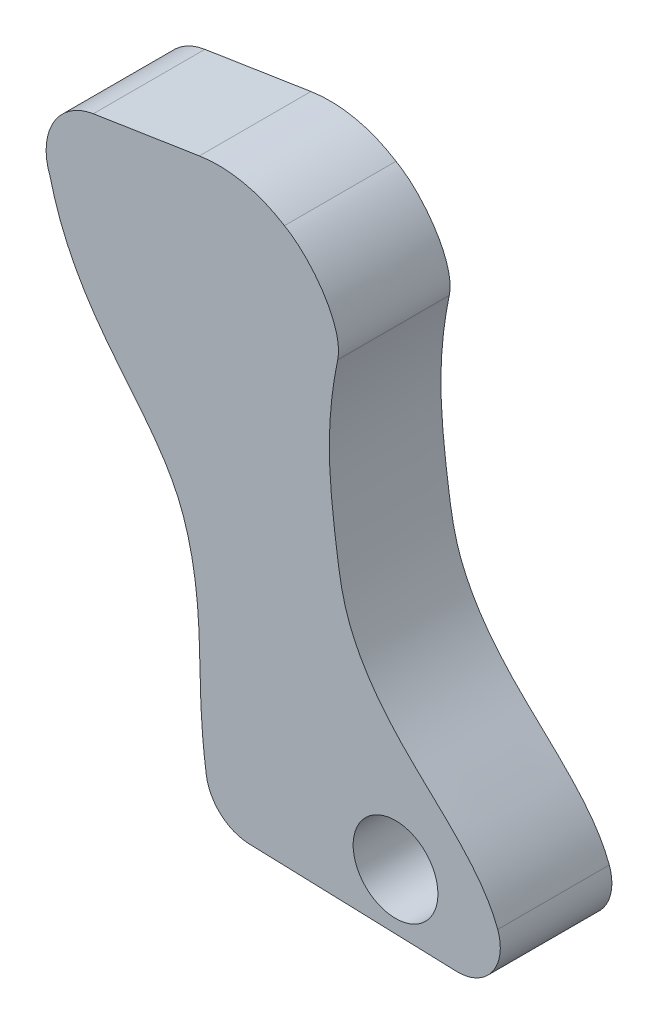
ISO-10303-21;
HEADER;
FILE_DESCRIPTION(('STEP AP214'),'2;1');
FILE_NAME('part.step','',(''),(''),'','','');
FILE_SCHEMA(('AUTOMOTIVE_DESIGN { 1 0 10303 214 1 1 1 1 }'));
ENDSEC;
DATA;
#1=APPLICATION_CONTEXT('core data for automotive mechanical design processes');
#2=APPLICATION_PROTOCOL_DEFINITION('international standard','automotive_design',2000,#1);
#3=PRODUCT_CONTEXT('',#1,'mechanical');
#4=PRODUCT('Part','Part','',(#3));
#5=PRODUCT_RELATED_PRODUCT_CATEGORY('part','',(#4));
#6=PRODUCT_DEFINITION_FORMATION('','',#4);
#7=PRODUCT_DEFINITION_CONTEXT('part definition',#1,'design');
#8=PRODUCT_DEFINITION('design','',#6,#7);
#9=PRODUCT_DEFINITION_SHAPE('','',#8);
#10=(LENGTH_UNIT() NAMED_UNIT(*) SI_UNIT(.MILLI.,.METRE.));
#11=(NAMED_UNIT(*) PLANE_ANGLE_UNIT() SI_UNIT($,.RADIAN.));
#12=(NAMED_UNIT(*) SI_UNIT($,.STERADIAN.) SOLID_ANGLE_UNIT());
#13=UNCERTAINTY_MEASURE_WITH_UNIT(LENGTH_MEASURE(1.E-05),#10,'distance_accuracy_value','');
#14=(GEOMETRIC_REPRESENTATION_CONTEXT(3) GLOBAL_UNCERTAINTY_ASSIGNED_CONTEXT((#13)) GLOBAL_UNIT_ASSIGNED_CONTEXT((#10,
#11,#12)) REPRESENTATION_CONTEXT('',''));
#15=CARTESIAN_POINT('',(0.,0.,0.));
#16=DIRECTION('',(0.,0.,1.));
#17=DIRECTION('',(1.,0.,0.));
#18=AXIS2_PLACEMENT_3D('',#15,#16,#17);
#19=CARTESIAN_POINT('',(-3.14253839049253,-0.228921941063467,0.));
#20=DIRECTION('',(0.,0.,-1.));
#21=DIRECTION('',(-1.,0.,0.));
#22=AXIS2_PLACEMENT_3D('',#19,#20,#21);
#23=PLANE('',#22);
#24=CARTESIAN_POINT('',(-6.05644366956368,4.64993578043893,0.));
#25=CARTESIAN_POINT('',(-5.47257523519971,2.24763452070451,0.));
#26=CARTESIAN_POINT('',(-3.14032497150458,0.912909200360138,0.));
#27=CARTESIAN_POINT('',(-2.56443138436627,-2.64735000201732,0.));
#28=CARTESIAN_POINT('',(-2.67735740290415,-4.14670790830453,0.));
#29=CARTESIAN_POINT('',(-2.4960943710409,-5.38562553156056,0.));
#30=B_SPLINE_CURVE_WITH_KNOTS('',3,(#24,#25,#26,#27,#28,#29),.UNSPECIFIED.,.F.,.F.,(4,1,1,4),
(0.,0.493395358191739,0.716015144874953,1.),.UNSPECIFIED.);
#31=CARTESIAN_POINT('',(-6.05644366956368,4.64993578043893,0.));
#32=VERTEX_POINT('',#31);
#33=CARTESIAN_POINT('',(-2.4960943710409,-5.38562553156056,0.));
#34=VERTEX_POINT('',#33);
#35=EDGE_CURVE('E140',#32,#34,#30,.T.);
#36=ORIENTED_EDGE('',*,*,#35,.F.);
#37=CARTESIAN_POINT('',(-4.87377055732532,5.11273628777276,0.));
#38=DIRECTION('',(0.,0.,1.));
#39=DIRECTION('',(-1.,0.,0.));
#40=AXIS2_PLACEMENT_3D('',#37,#38,#39);
#41=CIRCLE('',#40,1.27);
#42=CARTESIAN_POINT('',(-5.06916030594105,6.36761590197321,0.));
#43=VERTEX_POINT('',#42);
#44=EDGE_CURVE('E92',#43,#32,#41,.T.);
#45=ORIENTED_EDGE('',*,*,#44,.F.);
#46=DIRECTION('',(-0.988094184409806,-0.153850195760421,0.));
#47=VECTOR('',#46,1.);
#48=CARTESIAN_POINT('',(-5.06916030594105,6.36761590197321,0.));
#49=LINE('',#48,#47);
#50=CARTESIAN_POINT('',(-2.65503300036844,6.74350512833758,0.));
#51=VERTEX_POINT('',#50);
#52=EDGE_CURVE('E86',#51,#43,#49,.T.);
#53=ORIENTED_EDGE('',*,*,#52,.F.);
#54=CARTESIAN_POINT('',(-2.22517555341382,3.98276997709658,0.));
#55=DIRECTION('',(0.,0.,1.));
#56=DIRECTION('',(-1.,0.,0.));
#57=AXIS2_PLACEMENT_3D('',#54,#55,#56);
#58=CIRCLE('',#57,2.794);
#59=CARTESIAN_POINT('',(-0.718288865311653,6.33558287004419,0.));
#60=VERTEX_POINT('',#59);
#61=EDGE_CURVE('E130',#60,#51,#58,.T.);
#62=ORIENTED_EDGE('',*,*,#61,.F.);
#63=CARTESIAN_POINT('',(0.493851252231017,4.29665474391861,0.));
#64=CARTESIAN_POINT('',(0.640025428869317,5.00437062487667,0.));
#65=CARTESIAN_POINT('',(-0.121151201390224,6.00722954467493,0.));
#66=CARTESIAN_POINT('',(-0.718288865311653,6.33558287004419,0.));
#67=B_SPLINE_CURVE_WITH_KNOTS('',3,(#63,#64,#65,#66),.UNSPECIFIED.,.F.,.F.,(4,4),(0.,1.),.UNSPECIFIED.);
#68=CARTESIAN_POINT('',(0.493851252231017,4.29665474391861,0.));
#69=VERTEX_POINT('',#68);
#70=EDGE_CURVE('E159',#69,#60,#67,.T.);
#71=ORIENTED_EDGE('',*,*,#70,.F.);
#72=CARTESIAN_POINT('',(4.13756289532083,-5.11048341112105,0.));
#73=CARTESIAN_POINT('',(3.75170873669739,-4.057424722297,0.));
#74=CARTESIAN_POINT('',(1.96035292210392,-2.83840642684243,0.));
#75=CARTESIAN_POINT('',(0.682892056801707,-0.893226264426887,0.));
#76=CARTESIAN_POINT('',(0.419560201608327,0.841832203224972,0.));
#77=CARTESIAN_POINT('',(0.235366213775803,2.46513810879299,0.));
#78=CARTESIAN_POINT('',(0.366891084627688,3.68196527599495,0.));
#79=CARTESIAN_POINT('',(0.493851252231017,4.29665474391861,0.));
#80=B_SPLINE_CURVE_WITH_KNOTS('',3,(#72,#73,#74,#75,#76,#77,#78,#79),.UNSPECIFIED.,.F.,.F.,(4,1,
1,1,1,4),(0.,0.339614962532623,0.54378550735165,0.64451461107271,0.831601298882967,1.),.UNSPECIFIED.);
#81=CARTESIAN_POINT('',(4.13756289532083,-5.11048341112105,0.));
#82=VERTEX_POINT('',#81);
#83=EDGE_CURVE('E155',#82,#69,#80,.T.);
#84=ORIENTED_EDGE('',*,*,#83,.F.);
#85=CARTESIAN_POINT('',(3.23128512850863,-5.44255516448454,0.));
#86=DIRECTION('',(0.,0.,1.));
#87=DIRECTION('',(1.,0.,0.));
#88=AXIS2_PLACEMENT_3D('',#85,#86,#87);
#89=CIRCLE('',#88,0.965200000000001);
#90=CARTESIAN_POINT('',(3.19999026264176,-6.40724769133979,0.));
#91=VERTEX_POINT('',#90);
#92=EDGE_CURVE('E153',#91,#82,#89,.T.);
#93=ORIENTED_EDGE('',*,*,#92,.F.);
#94=DIRECTION('',(0.99947423006139,-0.0324231929826821,0.));
#95=VECTOR('',#94,1.);
#96=CARTESIAN_POINT('',(-1.52373901334253,-6.25400873699098,0.));
#97=LINE('',#96,#95);
#98=CARTESIAN_POINT('',(-1.52373901334253,-6.25400873699098,0.));
#99=VERTEX_POINT('',#98);
#100=EDGE_CURVE('E151',#99,#91,#97,.T.);
#101=ORIENTED_EDGE('',*,*,#100,.F.);
#102=CARTESIAN_POINT('',(-1.49079704927213,-5.23854291924861,0.));
#103=DIRECTION('',(0.,0.,1.));
#104=DIRECTION('',(1.,0.,0.));
#105=AXIS2_PLACEMENT_3D('',#102,#103,#104);
#106=CIRCLE('',#105,1.016);
#107=EDGE_CURVE('E145',#34,#99,#106,.T.);
#108=ORIENTED_EDGE('',*,*,#107,.F.);
#109=EDGE_LOOP('',(#36,#45,#53,#62,#71,#84,#93,#101,#108));
#110=FACE_BOUND('',#109,.T.);
#111=CARTESIAN_POINT('',(1.81120295072788,-5.0915270059297,0.));
#112=DIRECTION('',(0.,0.,1.));
#113=DIRECTION('',(1.,0.,0.));
#114=AXIS2_PLACEMENT_3D('',#111,#112,#113);
#115=CIRCLE('',#114,0.965199999999998);
#116=CARTESIAN_POINT('',(2.77640295072788,-5.0915270059297,0.));
#117=VERTEX_POINT('',#116);
#118=EDGE_CURVE('E146',#117,#117,#115,.T.);
#119=ORIENTED_EDGE('',*,*,#118,.T.);
#120=EDGE_LOOP('',(#119));
#121=FACE_BOUND('',#120,.T.);
#122=ADVANCED_FACE('F36',(#110,#121),#23,.T.);
#123=CARTESIAN_POINT('',(-6.05644366956368,4.64993578043894,2.54));
#124=CARTESIAN_POINT('',(-5.47257523519971,2.24763452070451,2.54));
#125=CARTESIAN_POINT('',(-3.1403249715046,0.912909200360142,2.54));
#126=CARTESIAN_POINT('',(-2.56443138436627,-2.64735000201731,2.54));
#127=CARTESIAN_POINT('',(-2.67735740290415,-4.14670790830453,2.54));
#128=CARTESIAN_POINT('',(-2.4960943710409,-5.38562553156056,2.54));
#129=B_SPLINE_CURVE_WITH_KNOTS('',3,(#123,#124,#125,#126,#127,#128),.UNSPECIFIED.,.F.,.F.,(4,1,
1,4),(0.,0.493395358191739,0.716015144874953,1.),.UNSPECIFIED.);
#130=DIRECTION('',(0.,0.,-1.));
#131=VECTOR('',#130,1.);
#132=SURFACE_OF_LINEAR_EXTRUSION('',#129,#131);
#133=ORIENTED_EDGE('',*,*,#35,.T.);
#134=DIRECTION('',(0.,0.,-1.));
#135=VECTOR('',#134,1.);
#136=CARTESIAN_POINT('',(-2.4960943710409,-5.38562553156056,2.54));
#137=LINE('',#136,#135);
#138=CARTESIAN_POINT('',(-2.4960943710409,-5.38562553156056,2.54));
#139=VERTEX_POINT('',#138);
#140=EDGE_CURVE('E11',#139,#34,#137,.T.);
#141=ORIENTED_EDGE('',*,*,#140,.F.);
#142=CARTESIAN_POINT('',(-6.05644366956368,4.64993578043894,2.54));
#143=VERTEX_POINT('',#142);
#144=EDGE_CURVE('E172',#143,#139,#129,.T.);
#145=ORIENTED_EDGE('',*,*,#144,.F.);
#146=DIRECTION('',(0.,0.,-1.));
#147=VECTOR('',#146,1.);
#148=CARTESIAN_POINT('',(-6.05644366956368,4.64993578043894,2.54));
#149=LINE('',#148,#147);
#150=EDGE_CURVE('E136',#143,#32,#149,.T.);
#151=ORIENTED_EDGE('',*,*,#150,.T.);
#152=EDGE_LOOP('',(#133,#141,#145,#151));
#153=FACE_BOUND('',#152,.T.);
#154=ADVANCED_FACE('F38',(#153),#132,.F.);
#155=CARTESIAN_POINT('',(-1.49079704927213,-5.23854291924861,2.54));
#156=DIRECTION('',(0.,0.,-1.));
#157=DIRECTION('',(-1.,0.,0.));
#158=AXIS2_PLACEMENT_3D('',#155,#156,#157);
#159=CYLINDRICAL_SURFACE('',#158,1.016);
#160=ORIENTED_EDGE('',*,*,#107,.T.);
#161=DIRECTION('',(0.,0.,-1.));
#162=VECTOR('',#161,1.);
#163=CARTESIAN_POINT('',(-1.52373901334253,-6.25400873699098,2.54));
#164=LINE('',#163,#162);
#165=CARTESIAN_POINT('',(-1.52373901334253,-6.25400873699098,2.54));
#166=VERTEX_POINT('',#165);
#167=EDGE_CURVE('E46',#166,#99,#164,.T.);
#168=ORIENTED_EDGE('',*,*,#167,.F.);
#169=CARTESIAN_POINT('',(-1.49079704927213,-5.23854291924861,2.54));
#170=DIRECTION('',(0.,0.,1.));
#171=DIRECTION('',(1.,0.,0.));
#172=AXIS2_PLACEMENT_3D('',#169,#170,#171);
#173=CIRCLE('',#172,1.016);
#174=EDGE_CURVE('E100',#139,#166,#173,.T.);
#175=ORIENTED_EDGE('',*,*,#174,.F.);
#176=ORIENTED_EDGE('',*,*,#140,.T.);
#177=EDGE_LOOP('',(#160,#168,#175,#176));
#178=FACE_BOUND('',#177,.T.);
#179=ADVANCED_FACE('F228',(#178),#159,.T.);
#180=CARTESIAN_POINT('',(-1.52373901334253,-6.25400873699098,2.54));
#181=DIRECTION('',(0.032423192982682,0.99947423006139,0.));
#182=DIRECTION('',(-0.99947423006139,0.032423192982682,0.));
#183=AXIS2_PLACEMENT_3D('',#180,#181,#182);
#184=PLANE('',#183);
#185=ORIENTED_EDGE('',*,*,#100,.T.);
#186=DIRECTION('',(0.,0.,-1.));
#187=VECTOR('',#186,1.);
#188=CARTESIAN_POINT('',(3.19999026264174,-6.40724769133978,2.54));
#189=LINE('',#188,#187);
#190=CARTESIAN_POINT('',(3.19999026264174,-6.40724769133978,2.54));
#191=VERTEX_POINT('',#190);
#192=EDGE_CURVE('E182',#191,#91,#189,.T.);
#193=ORIENTED_EDGE('',*,*,#192,.F.);
#194=DIRECTION('',(0.99947423006139,-0.0324231929826821,0.));
#195=VECTOR('',#194,1.);
#196=CARTESIAN_POINT('',(-1.52373901334253,-6.25400873699098,2.54));
#197=LINE('',#196,#195);
#198=EDGE_CURVE('E190',#166,#191,#197,.T.);
#199=ORIENTED_EDGE('',*,*,#198,.F.);
#200=ORIENTED_EDGE('',*,*,#167,.T.);
#201=EDGE_LOOP('',(#185,#193,#199,#200));
#202=FACE_BOUND('',#201,.T.);
#203=ADVANCED_FACE('F188',(#202),#184,.F.);
#204=CARTESIAN_POINT('',(3.23128512850863,-5.44255516448453,2.54));
#205=DIRECTION('',(0.,0.,-1.));
#206=DIRECTION('',(-1.,0.,0.));
#207=AXIS2_PLACEMENT_3D('',#204,#205,#206);
#208=CYLINDRICAL_SURFACE('',#207,0.965200000000001);
#209=ORIENTED_EDGE('',*,*,#92,.T.);
#210=DIRECTION('',(0.,0.,-1.));
#211=VECTOR('',#210,1.);
#212=CARTESIAN_POINT('',(4.13756289532083,-5.11048341112104,2.54));
#213=LINE('',#212,#211);
#214=CARTESIAN_POINT('',(4.13756289532083,-5.11048341112104,2.54));
#215=VERTEX_POINT('',#214);
#216=EDGE_CURVE('E179',#215,#82,#213,.T.);
#217=ORIENTED_EDGE('',*,*,#216,.F.);
#218=CARTESIAN_POINT('',(3.23128512850863,-5.44255516448453,2.54));
#219=DIRECTION('',(0.,0.,1.));
#220=DIRECTION('',(1.,0.,0.));
#221=AXIS2_PLACEMENT_3D('',#218,#219,#220);
#222=CIRCLE('',#221,0.965200000000001);
#223=EDGE_CURVE('E206',#191,#215,#222,.T.);
#224=ORIENTED_EDGE('',*,*,#223,.F.);
#225=ORIENTED_EDGE('',*,*,#192,.T.);
#226=EDGE_LOOP('',(#209,#217,#224,#225));
#227=FACE_BOUND('',#226,.T.);
#228=ADVANCED_FACE('F199',(#227),#208,.T.);
#229=CARTESIAN_POINT('',(4.13756289532083,-5.11048341112104,2.54));
#230=CARTESIAN_POINT('',(3.75170873669739,-4.05742472229701,2.54));
#231=CARTESIAN_POINT('',(1.96035292210392,-2.83840642684243,2.54));
#232=CARTESIAN_POINT('',(0.682892056801707,-0.893226264426887,2.54));
#233=CARTESIAN_POINT('',(0.419560201608327,0.841832203224972,2.54));
#234=CARTESIAN_POINT('',(0.235366213775803,2.46513810879299,2.54));
#235=CARTESIAN_POINT('',(0.366891084627688,3.68196527599496,2.54));
#236=CARTESIAN_POINT('',(0.493851252231017,4.29665474391861,2.54));
#237=B_SPLINE_CURVE_WITH_KNOTS('',3,(#229,#230,#231,#232,#233,#234,#235,#236),.UNSPECIFIED.,.F.,
.F.,(4,1,1,1,1,4),(0.,0.339614962532623,0.54378550735165,0.64451461107271,0.831601298882967,1.),.UNSPECIFIED.);
#238=DIRECTION('',(0.,0.,-1.));
#239=VECTOR('',#238,1.);
#240=SURFACE_OF_LINEAR_EXTRUSION('',#237,#239);
#241=ORIENTED_EDGE('',*,*,#83,.T.);
#242=DIRECTION('',(0.,0.,-1.));
#243=VECTOR('',#242,1.);
#244=CARTESIAN_POINT('',(0.493851252231017,4.29665474391861,2.54));
#245=LINE('',#244,#243);
#246=CARTESIAN_POINT('',(0.493851252231017,4.29665474391861,2.54));
#247=VERTEX_POINT('',#246);
#248=EDGE_CURVE('E176',#247,#69,#245,.T.);
#249=ORIENTED_EDGE('',*,*,#248,.F.);
#250=EDGE_CURVE('E205',#215,#247,#237,.T.);
#251=ORIENTED_EDGE('',*,*,#250,.F.);
#252=ORIENTED_EDGE('',*,*,#216,.T.);
#253=EDGE_LOOP('',(#241,#249,#251,#252));
#254=FACE_BOUND('',#253,.T.);
#255=ADVANCED_FACE('F203',(#254),#240,.F.);
#256=CARTESIAN_POINT('',(0.493851252231017,4.29665474391861,2.54));
#257=CARTESIAN_POINT('',(0.640025428869317,5.00437062487667,2.54));
#258=CARTESIAN_POINT('',(-0.121151201390238,6.00722954467493,2.54));
#259=CARTESIAN_POINT('',(-0.718288865311653,6.33558287004419,2.54));
#260=B_SPLINE_CURVE_WITH_KNOTS('',3,(#256,#257,#258,#259),.UNSPECIFIED.,.F.,.F.,(4,4),(0.,1.),.UNSPECIFIED.);
#261=DIRECTION('',(0.,0.,-1.));
#262=VECTOR('',#261,1.);
#263=SURFACE_OF_LINEAR_EXTRUSION('',#260,#262);
#264=ORIENTED_EDGE('',*,*,#70,.T.);
#265=DIRECTION('',(0.,0.,-1.));
#266=VECTOR('',#265,1.);
#267=CARTESIAN_POINT('',(-0.718288865311653,6.33558287004419,2.54));
#268=LINE('',#267,#266);
#269=CARTESIAN_POINT('',(-0.718288865311653,6.33558287004419,2.54));
#270=VERTEX_POINT('',#269);
#271=EDGE_CURVE('E131',#270,#60,#268,.T.);
#272=ORIENTED_EDGE('',*,*,#271,.F.);
#273=EDGE_CURVE('E122',#247,#270,#260,.T.);
#274=ORIENTED_EDGE('',*,*,#273,.F.);
#275=ORIENTED_EDGE('',*,*,#248,.T.);
#276=EDGE_LOOP('',(#264,#272,#274,#275));
#277=FACE_BOUND('',#276,.T.);
#278=ADVANCED_FACE('F223',(#277),#263,.F.);
#279=CARTESIAN_POINT('',(-2.22517555341382,3.98276997709658,2.54));
#280=DIRECTION('',(0.,0.,-1.));
#281=DIRECTION('',(-1.,0.,0.));
#282=AXIS2_PLACEMENT_3D('',#279,#280,#281);
#283=CYLINDRICAL_SURFACE('',#282,2.794);
#284=ORIENTED_EDGE('',*,*,#61,.T.);
#285=DIRECTION('',(0.,0.,-1.));
#286=VECTOR('',#285,1.);
#287=CARTESIAN_POINT('',(-2.65503300036844,6.74350512833758,2.54));
#288=LINE('',#287,#286);
#289=CARTESIAN_POINT('',(-2.65503300036844,6.74350512833758,2.54));
#290=VERTEX_POINT('',#289);
#291=EDGE_CURVE('E127',#290,#51,#288,.T.);
#292=ORIENTED_EDGE('',*,*,#291,.F.);
#293=CARTESIAN_POINT('',(-2.22517555341382,3.98276997709658,2.54));
#294=DIRECTION('',(0.,0.,1.));
#295=DIRECTION('',(-1.,0.,0.));
#296=AXIS2_PLACEMENT_3D('',#293,#294,#295);
#297=CIRCLE('',#296,2.794);
#298=EDGE_CURVE('E116',#270,#290,#297,.T.);
#299=ORIENTED_EDGE('',*,*,#298,.F.);
#300=ORIENTED_EDGE('',*,*,#271,.T.);
#301=EDGE_LOOP('',(#284,#292,#299,#300));
#302=FACE_BOUND('',#301,.T.);
#303=ADVANCED_FACE('F128',(#302),#283,.T.);
#304=CARTESIAN_POINT('',(-5.06916030594105,6.36761590197322,2.54));
#305=DIRECTION('',(0.153850195760421,-0.988094184409806,0.));
#306=DIRECTION('',(0.988094184409807,0.153850195760421,0.));
#307=AXIS2_PLACEMENT_3D('',#304,#305,#306);
#308=PLANE('',#307);
#309=ORIENTED_EDGE('',*,*,#52,.T.);
#310=DIRECTION('',(0.,0.,-1.));
#311=VECTOR('',#310,1.);
#312=CARTESIAN_POINT('',(-5.06916030594105,6.36761590197322,2.54));
#313=LINE('',#312,#311);
#314=CARTESIAN_POINT('',(-5.06916030594105,6.36761590197322,2.54));
#315=VERTEX_POINT('',#314);
#316=EDGE_CURVE('E132',#315,#43,#313,.T.);
#317=ORIENTED_EDGE('',*,*,#316,.F.);
#318=DIRECTION('',(-0.988094184409806,-0.153850195760421,0.));
#319=VECTOR('',#318,1.);
#320=CARTESIAN_POINT('',(-5.06916030594105,6.36761590197322,2.54));
#321=LINE('',#320,#319);
#322=EDGE_CURVE('E120',#290,#315,#321,.T.);
#323=ORIENTED_EDGE('',*,*,#322,.F.);
#324=ORIENTED_EDGE('',*,*,#291,.T.);
#325=EDGE_LOOP('',(#309,#317,#323,#324));
#326=FACE_BOUND('',#325,.T.);
#327=ADVANCED_FACE('F134',(#326),#308,.F.);
#328=CARTESIAN_POINT('',(-4.87377055732532,5.11273628777276,2.54));
#329=DIRECTION('',(0.,0.,-1.));
#330=DIRECTION('',(-1.,0.,0.));
#331=AXIS2_PLACEMENT_3D('',#328,#329,#330);
#332=CYLINDRICAL_SURFACE('',#331,1.27);
#333=ORIENTED_EDGE('',*,*,#44,.T.);
#334=ORIENTED_EDGE('',*,*,#150,.F.);
#335=CARTESIAN_POINT('',(-4.87377055732532,5.11273628777276,2.54));
#336=DIRECTION('',(0.,0.,1.));
#337=DIRECTION('',(-1.,0.,0.));
#338=AXIS2_PLACEMENT_3D('',#335,#336,#337);
#339=CIRCLE('',#338,1.27);
#340=EDGE_CURVE('E54',#315,#143,#339,.T.);
#341=ORIENTED_EDGE('',*,*,#340,.F.);
#342=ORIENTED_EDGE('',*,*,#316,.T.);
#343=EDGE_LOOP('',(#333,#334,#341,#342));
#344=FACE_BOUND('',#343,.T.);
#345=ADVANCED_FACE('F241',(#344),#332,.T.);
#346=CARTESIAN_POINT('',(-3.14253839049253,-0.228921941063467,2.54));
#347=DIRECTION('',(0.,0.,-1.));
#348=DIRECTION('',(-1.,0.,0.));
#349=AXIS2_PLACEMENT_3D('',#346,#347,#348);
#350=PLANE('',#349);
#351=CARTESIAN_POINT('',(1.81120295072788,-5.0915270059297,2.54));
#352=DIRECTION('',(0.,0.,1.));
#353=DIRECTION('',(1.,0.,0.));
#354=AXIS2_PLACEMENT_3D('',#351,#352,#353);
#355=CIRCLE('',#354,0.965199999999999);
#356=CARTESIAN_POINT('',(2.77640295072788,-5.0915270059297,2.54));
#357=VERTEX_POINT('',#356);
#358=EDGE_CURVE('E264',#357,#357,#355,.T.);
#359=ORIENTED_EDGE('',*,*,#358,.F.);
#360=EDGE_LOOP('',(#359));
#361=FACE_BOUND('',#360,.T.);
#362=ORIENTED_EDGE('',*,*,#144,.T.);
#363=ORIENTED_EDGE('',*,*,#174,.T.);
#364=ORIENTED_EDGE('',*,*,#198,.T.);
#365=ORIENTED_EDGE('',*,*,#223,.T.);
#366=ORIENTED_EDGE('',*,*,#250,.T.);
#367=ORIENTED_EDGE('',*,*,#273,.T.);
#368=ORIENTED_EDGE('',*,*,#298,.T.);
#369=ORIENTED_EDGE('',*,*,#322,.T.);
#370=ORIENTED_EDGE('',*,*,#340,.T.);
#371=EDGE_LOOP('',(#362,#363,#364,#365,#366,#367,#368,#369,#370));
#372=FACE_BOUND('',#371,.T.);
#373=ADVANCED_FACE('F118',(#361,#372),#350,.F.);
#374=CARTESIAN_POINT('',(1.81120295072788,-5.0915270059297,2.54));
#375=DIRECTION('',(0.,0.,1.));
#376=DIRECTION('',(1.,0.,0.));
#377=AXIS2_PLACEMENT_3D('',#374,#375,#376);
#378=CYLINDRICAL_SURFACE('',#377,0.965199999999998);
#379=ORIENTED_EDGE('',*,*,#118,.F.);
#380=EDGE_LOOP('',(#379));
#381=FACE_BOUND('',#380,.T.);
#382=ORIENTED_EDGE('',*,*,#358,.T.);
#383=EDGE_LOOP('',(#382));
#384=FACE_BOUND('',#383,.T.);
#385=ADVANCED_FACE('F268',(#381,#384),#378,.F.);
#386=CLOSED_SHELL('',(#122,#154,#179,#203,#228,#255,#278,#303,#327,#345,#373,#385));
#387=MANIFOLD_SOLID_BREP('B2',#386);
#388=ADVANCED_BREP_SHAPE_REPRESENTATION('',(#18,#387),#14);
#389=SHAPE_DEFINITION_REPRESENTATION(#9,#388);
ENDSEC;
END-ISO-10303-21;
